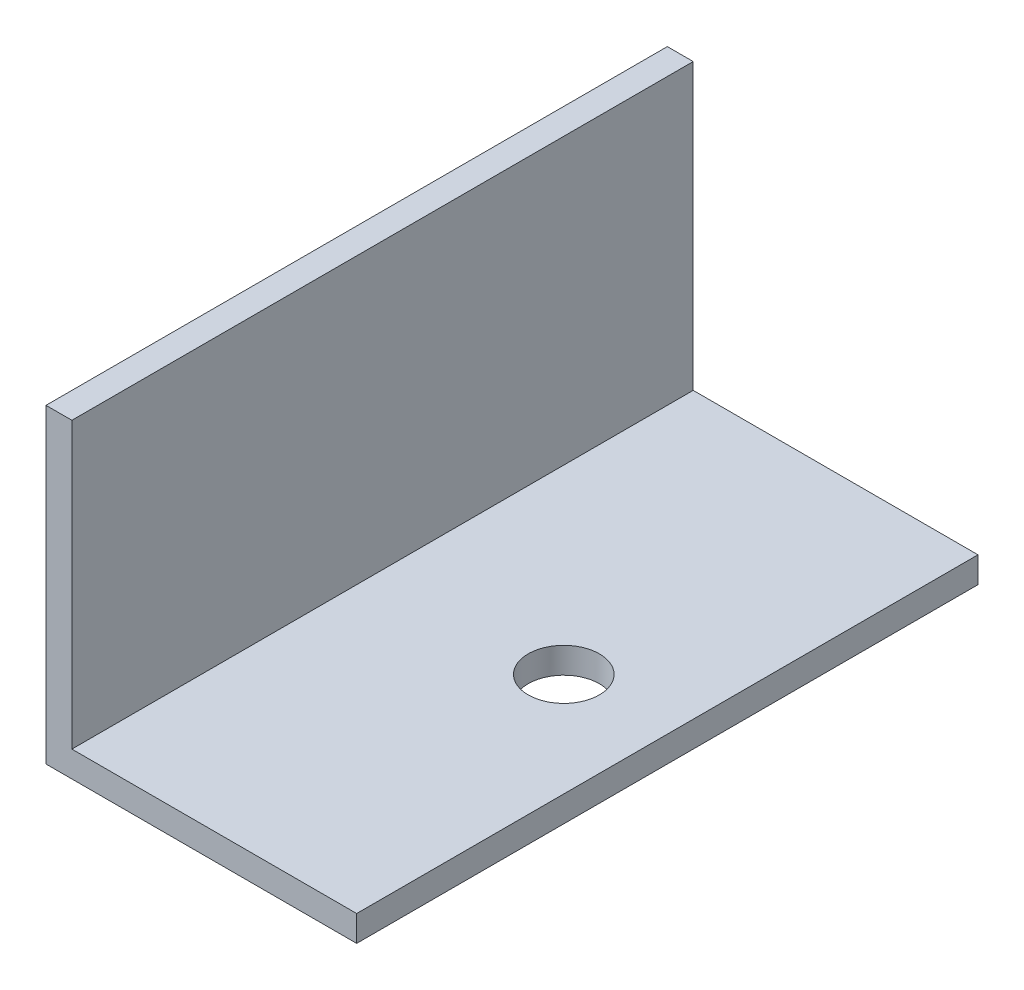
ISO-10303-21;
HEADER;
FILE_DESCRIPTION(('STEP AP214'),'2;1');
FILE_NAME('part.step','',(''),(''),'','','');
FILE_SCHEMA(('AUTOMOTIVE_DESIGN { 1 0 10303 214 1 1 1 1 }'));
ENDSEC;
DATA;
#1=APPLICATION_CONTEXT('core data for automotive mechanical design processes');
#2=APPLICATION_PROTOCOL_DEFINITION('international standard','automotive_design',2000,#1);
#3=PRODUCT_CONTEXT('',#1,'mechanical');
#4=PRODUCT('Part','Part','',(#3));
#5=PRODUCT_RELATED_PRODUCT_CATEGORY('part','',(#4));
#6=PRODUCT_DEFINITION_FORMATION('','',#4);
#7=PRODUCT_DEFINITION_CONTEXT('part definition',#1,'design');
#8=PRODUCT_DEFINITION('design','',#6,#7);
#9=PRODUCT_DEFINITION_SHAPE('','',#8);
#10=(LENGTH_UNIT() NAMED_UNIT(*) SI_UNIT(.MILLI.,.METRE.));
#11=(NAMED_UNIT(*) PLANE_ANGLE_UNIT() SI_UNIT($,.RADIAN.));
#12=(NAMED_UNIT(*) SI_UNIT($,.STERADIAN.) SOLID_ANGLE_UNIT());
#13=UNCERTAINTY_MEASURE_WITH_UNIT(LENGTH_MEASURE(1.E-05),#10,'distance_accuracy_value','');
#14=(GEOMETRIC_REPRESENTATION_CONTEXT(3) GLOBAL_UNCERTAINTY_ASSIGNED_CONTEXT((#13)) GLOBAL_UNIT_ASSIGNED_CONTEXT((#10,
#11,#12)) REPRESENTATION_CONTEXT('',''));
#15=CARTESIAN_POINT('',(0.,0.,0.));
#16=DIRECTION('',(0.,0.,1.));
#17=DIRECTION('',(1.,0.,0.));
#18=AXIS2_PLACEMENT_3D('',#15,#16,#17);
#19=CARTESIAN_POINT('',(0.,38.1,38.1));
#20=DIRECTION('',(1.,0.,0.));
#21=DIRECTION('',(0.,0.,-1.));
#22=AXIS2_PLACEMENT_3D('',#19,#20,#21);
#23=PLANE('',#22);
#24=DIRECTION('',(0.,-1.,0.));
#25=VECTOR('',#24,1.);
#26=CARTESIAN_POINT('',(0.,38.1,-38.1));
#27=LINE('',#26,#25);
#28=CARTESIAN_POINT('',(0.,38.1,-38.1));
#29=VERTEX_POINT('',#28);
#30=CARTESIAN_POINT('',(0.,0.,-38.1));
#31=VERTEX_POINT('',#30);
#32=EDGE_CURVE('E117',#29,#31,#27,.T.);
#33=ORIENTED_EDGE('',*,*,#32,.T.);
#34=DIRECTION('',(0.,0.,-1.));
#35=VECTOR('',#34,1.);
#36=CARTESIAN_POINT('',(0.,0.,38.1));
#37=LINE('',#36,#35);
#38=CARTESIAN_POINT('',(0.,0.,38.1));
#39=VERTEX_POINT('',#38);
#40=EDGE_CURVE('E11',#39,#31,#37,.T.);
#41=ORIENTED_EDGE('',*,*,#40,.F.);
#42=DIRECTION('',(0.,-1.,0.));
#43=VECTOR('',#42,1.);
#44=CARTESIAN_POINT('',(0.,38.1,38.1));
#45=LINE('',#44,#43);
#46=CARTESIAN_POINT('',(0.,38.1,38.1));
#47=VERTEX_POINT('',#46);
#48=EDGE_CURVE('E128',#47,#39,#45,.T.);
#49=ORIENTED_EDGE('',*,*,#48,.F.);
#50=DIRECTION('',(0.,0.,-1.));
#51=VECTOR('',#50,1.);
#52=CARTESIAN_POINT('',(0.,38.1,38.1));
#53=LINE('',#52,#51);
#54=EDGE_CURVE('E113',#47,#29,#53,.T.);
#55=ORIENTED_EDGE('',*,*,#54,.T.);
#56=EDGE_LOOP('',(#33,#41,#49,#55));
#57=FACE_BOUND('',#56,.T.);
#58=ADVANCED_FACE('F33',(#57),#23,.F.);
#59=CARTESIAN_POINT('',(0.,0.,38.1));
#60=DIRECTION('',(0.,1.,0.));
#61=DIRECTION('',(-1.,0.,0.));
#62=AXIS2_PLACEMENT_3D('',#59,#60,#61);
#63=PLANE('',#62);
#64=CARTESIAN_POINT('',(25.4,0.,0.));
#65=DIRECTION('',(0.,1.,0.));
#66=DIRECTION('',(-1.,0.,0.));
#67=AXIS2_PLACEMENT_3D('',#64,#65,#66);
#68=CIRCLE('',#67,4.365625);
#69=CARTESIAN_POINT('',(21.034375,0.,0.));
#70=VERTEX_POINT('',#69);
#71=EDGE_CURVE('E121',#70,#70,#68,.F.);
#72=ORIENTED_EDGE('',*,*,#71,.F.);
#73=EDGE_LOOP('',(#72));
#74=FACE_BOUND('',#73,.T.);
#75=DIRECTION('',(1.,0.,0.));
#76=VECTOR('',#75,1.);
#77=CARTESIAN_POINT('',(0.,0.,-38.1));
#78=LINE('',#77,#76);
#79=CARTESIAN_POINT('',(38.1,0.,-38.1));
#80=VERTEX_POINT('',#79);
#81=EDGE_CURVE('E120',#31,#80,#78,.T.);
#82=ORIENTED_EDGE('',*,*,#81,.T.);
#83=DIRECTION('',(0.,0.,-1.));
#84=VECTOR('',#83,1.);
#85=CARTESIAN_POINT('',(38.1,0.,38.1));
#86=LINE('',#85,#84);
#87=CARTESIAN_POINT('',(38.1,0.,38.1));
#88=VERTEX_POINT('',#87);
#89=EDGE_CURVE('E41',#88,#80,#86,.T.);
#90=ORIENTED_EDGE('',*,*,#89,.F.);
#91=DIRECTION('',(1.,0.,0.));
#92=VECTOR('',#91,1.);
#93=CARTESIAN_POINT('',(0.,0.,38.1));
#94=LINE('',#93,#92);
#95=EDGE_CURVE('E86',#39,#88,#94,.T.);
#96=ORIENTED_EDGE('',*,*,#95,.F.);
#97=ORIENTED_EDGE('',*,*,#40,.T.);
#98=EDGE_LOOP('',(#82,#90,#96,#97));
#99=FACE_BOUND('',#98,.T.);
#100=ADVANCED_FACE('F152',(#74,#99),#63,.F.);
#101=CARTESIAN_POINT('',(38.1,0.,38.1));
#102=DIRECTION('',(-1.,0.,0.));
#103=DIRECTION('',(0.,0.,1.));
#104=AXIS2_PLACEMENT_3D('',#101,#102,#103);
#105=PLANE('',#104);
#106=DIRECTION('',(0.,1.,0.));
#107=VECTOR('',#106,1.);
#108=CARTESIAN_POINT('',(38.1,0.,-38.1));
#109=LINE('',#108,#107);
#110=CARTESIAN_POINT('',(38.1,3.175,-38.1));
#111=VERTEX_POINT('',#110);
#112=EDGE_CURVE('E123',#80,#111,#109,.T.);
#113=ORIENTED_EDGE('',*,*,#112,.T.);
#114=DIRECTION('',(0.,0.,-1.));
#115=VECTOR('',#114,1.);
#116=CARTESIAN_POINT('',(38.1,3.175,38.1));
#117=LINE('',#116,#115);
#118=CARTESIAN_POINT('',(38.1,3.175,38.1));
#119=VERTEX_POINT('',#118);
#120=EDGE_CURVE('E108',#119,#111,#117,.T.);
#121=ORIENTED_EDGE('',*,*,#120,.F.);
#122=DIRECTION('',(0.,1.,0.));
#123=VECTOR('',#122,1.);
#124=CARTESIAN_POINT('',(38.1,0.,38.1));
#125=LINE('',#124,#123);
#126=EDGE_CURVE('E99',#88,#119,#125,.T.);
#127=ORIENTED_EDGE('',*,*,#126,.F.);
#128=ORIENTED_EDGE('',*,*,#89,.T.);
#129=EDGE_LOOP('',(#113,#121,#127,#128));
#130=FACE_BOUND('',#129,.T.);
#131=ADVANCED_FACE('F134',(#130),#105,.F.);
#132=CARTESIAN_POINT('',(38.1,3.175,38.1));
#133=DIRECTION('',(0.,-1.,0.));
#134=DIRECTION('',(0.,0.,-1.));
#135=AXIS2_PLACEMENT_3D('',#132,#133,#134);
#136=PLANE('',#135);
#137=CARTESIAN_POINT('',(25.4,3.175,0.));
#138=DIRECTION('',(0.,1.,0.));
#139=DIRECTION('',(0.,0.,1.));
#140=AXIS2_PLACEMENT_3D('',#137,#138,#139);
#141=CIRCLE('',#140,4.365625);
#142=CARTESIAN_POINT('',(25.4,3.175,4.365625));
#143=VERTEX_POINT('',#142);
#144=EDGE_CURVE('E171',#143,#143,#141,.T.);
#145=ORIENTED_EDGE('',*,*,#144,.F.);
#146=EDGE_LOOP('',(#145));
#147=FACE_BOUND('',#146,.T.);
#148=DIRECTION('',(-1.,0.,0.));
#149=VECTOR('',#148,1.);
#150=CARTESIAN_POINT('',(38.1,3.175,-38.1));
#151=LINE('',#150,#149);
#152=CARTESIAN_POINT('',(3.175,3.175,-38.1));
#153=VERTEX_POINT('',#152);
#154=EDGE_CURVE('E107',#111,#153,#151,.T.);
#155=ORIENTED_EDGE('',*,*,#154,.T.);
#156=DIRECTION('',(0.,0.,-1.));
#157=VECTOR('',#156,1.);
#158=CARTESIAN_POINT('',(3.175,3.175,38.1));
#159=LINE('',#158,#157);
#160=CARTESIAN_POINT('',(3.175,3.175,38.1));
#161=VERTEX_POINT('',#160);
#162=EDGE_CURVE('E104',#161,#153,#159,.T.);
#163=ORIENTED_EDGE('',*,*,#162,.F.);
#164=DIRECTION('',(-1.,0.,0.));
#165=VECTOR('',#164,1.);
#166=CARTESIAN_POINT('',(38.1,3.175,38.1));
#167=LINE('',#166,#165);
#168=EDGE_CURVE('E93',#119,#161,#167,.T.);
#169=ORIENTED_EDGE('',*,*,#168,.F.);
#170=ORIENTED_EDGE('',*,*,#120,.T.);
#171=EDGE_LOOP('',(#155,#163,#169,#170));
#172=FACE_BOUND('',#171,.T.);
#173=ADVANCED_FACE('F105',(#147,#172),#136,.F.);
#174=CARTESIAN_POINT('',(3.175,3.175,38.1));
#175=DIRECTION('',(-1.,0.,0.));
#176=DIRECTION('',(0.,-1.,0.));
#177=AXIS2_PLACEMENT_3D('',#174,#175,#176);
#178=PLANE('',#177);
#179=DIRECTION('',(0.,1.,0.));
#180=VECTOR('',#179,1.);
#181=CARTESIAN_POINT('',(3.175,3.175,-38.1));
#182=LINE('',#181,#180);
#183=CARTESIAN_POINT('',(3.175,38.1,-38.1));
#184=VERTEX_POINT('',#183);
#185=EDGE_CURVE('E72',#153,#184,#182,.T.);
#186=ORIENTED_EDGE('',*,*,#185,.T.);
#187=DIRECTION('',(0.,0.,-1.));
#188=VECTOR('',#187,1.);
#189=CARTESIAN_POINT('',(3.175,38.1,38.1));
#190=LINE('',#189,#188);
#191=CARTESIAN_POINT('',(3.175,38.1,38.1));
#192=VERTEX_POINT('',#191);
#193=EDGE_CURVE('E109',#192,#184,#190,.T.);
#194=ORIENTED_EDGE('',*,*,#193,.F.);
#195=DIRECTION('',(0.,1.,0.));
#196=VECTOR('',#195,1.);
#197=CARTESIAN_POINT('',(3.175,3.175,38.1));
#198=LINE('',#197,#196);
#199=EDGE_CURVE('E97',#161,#192,#198,.T.);
#200=ORIENTED_EDGE('',*,*,#199,.F.);
#201=ORIENTED_EDGE('',*,*,#162,.T.);
#202=EDGE_LOOP('',(#186,#194,#200,#201));
#203=FACE_BOUND('',#202,.T.);
#204=ADVANCED_FACE('F111',(#203),#178,.F.);
#205=CARTESIAN_POINT('',(3.175,38.1,38.1));
#206=DIRECTION('',(0.,-1.,0.));
#207=DIRECTION('',(0.,0.,-1.));
#208=AXIS2_PLACEMENT_3D('',#205,#206,#207);
#209=PLANE('',#208);
#210=DIRECTION('',(-1.,0.,0.));
#211=VECTOR('',#210,1.);
#212=CARTESIAN_POINT('',(3.175,38.1,-38.1));
#213=LINE('',#212,#211);
#214=EDGE_CURVE('E78',#184,#29,#213,.T.);
#215=ORIENTED_EDGE('',*,*,#214,.T.);
#216=ORIENTED_EDGE('',*,*,#54,.F.);
#217=DIRECTION('',(-1.,0.,0.));
#218=VECTOR('',#217,1.);
#219=CARTESIAN_POINT('',(3.175,38.1,38.1));
#220=LINE('',#219,#218);
#221=EDGE_CURVE('E49',#192,#47,#220,.T.);
#222=ORIENTED_EDGE('',*,*,#221,.F.);
#223=ORIENTED_EDGE('',*,*,#193,.T.);
#224=EDGE_LOOP('',(#215,#216,#222,#223));
#225=FACE_BOUND('',#224,.T.);
#226=ADVANCED_FACE('F141',(#225),#209,.F.);
#227=CARTESIAN_POINT('',(0.,0.,38.1));
#228=DIRECTION('',(0.,0.,1.));
#229=DIRECTION('',(1.,0.,0.));
#230=AXIS2_PLACEMENT_3D('',#227,#228,#229);
#231=PLANE('',#230);
#232=ORIENTED_EDGE('',*,*,#48,.T.);
#233=ORIENTED_EDGE('',*,*,#95,.T.);
#234=ORIENTED_EDGE('',*,*,#126,.T.);
#235=ORIENTED_EDGE('',*,*,#168,.T.);
#236=ORIENTED_EDGE('',*,*,#199,.T.);
#237=ORIENTED_EDGE('',*,*,#221,.T.);
#238=EDGE_LOOP('',(#232,#233,#234,#235,#236,#237));
#239=FACE_BOUND('',#238,.T.);
#240=ADVANCED_FACE('F95',(#239),#231,.T.);
#241=CARTESIAN_POINT('',(0.,0.,-38.1));
#242=DIRECTION('',(0.,0.,1.));
#243=DIRECTION('',(1.,0.,0.));
#244=AXIS2_PLACEMENT_3D('',#241,#242,#243);
#245=PLANE('',#244);
#246=ORIENTED_EDGE('',*,*,#32,.F.);
#247=ORIENTED_EDGE('',*,*,#214,.F.);
#248=ORIENTED_EDGE('',*,*,#185,.F.);
#249=ORIENTED_EDGE('',*,*,#154,.F.);
#250=ORIENTED_EDGE('',*,*,#112,.F.);
#251=ORIENTED_EDGE('',*,*,#81,.F.);
#252=EDGE_LOOP('',(#246,#247,#248,#249,#250,#251));
#253=FACE_BOUND('',#252,.T.);
#254=ADVANCED_FACE('F137',(#253),#245,.F.);
#255=CARTESIAN_POINT('',(25.4,-0.00100000000000013,0.));
#256=DIRECTION('',(0.,1.,0.));
#257=DIRECTION('',(0.,0.,1.));
#258=AXIS2_PLACEMENT_3D('',#255,#256,#257);
#259=CYLINDRICAL_SURFACE('',#258,4.365625);
#260=ORIENTED_EDGE('',*,*,#144,.T.);
#261=EDGE_LOOP('',(#260));
#262=FACE_BOUND('',#261,.T.);
#263=ORIENTED_EDGE('',*,*,#71,.T.);
#264=EDGE_LOOP('',(#263));
#265=FACE_BOUND('',#264,.T.);
#266=ADVANCED_FACE('F179',(#262,#265),#259,.F.);
#267=CLOSED_SHELL('',(#58,#100,#131,#173,#204,#226,#240,#254,#266));
#268=MANIFOLD_SOLID_BREP('B2',#267);
#269=ADVANCED_BREP_SHAPE_REPRESENTATION('',(#18,#268),#14);
#270=SHAPE_DEFINITION_REPRESENTATION(#9,#269);
ENDSEC;
END-ISO-10303-21;
